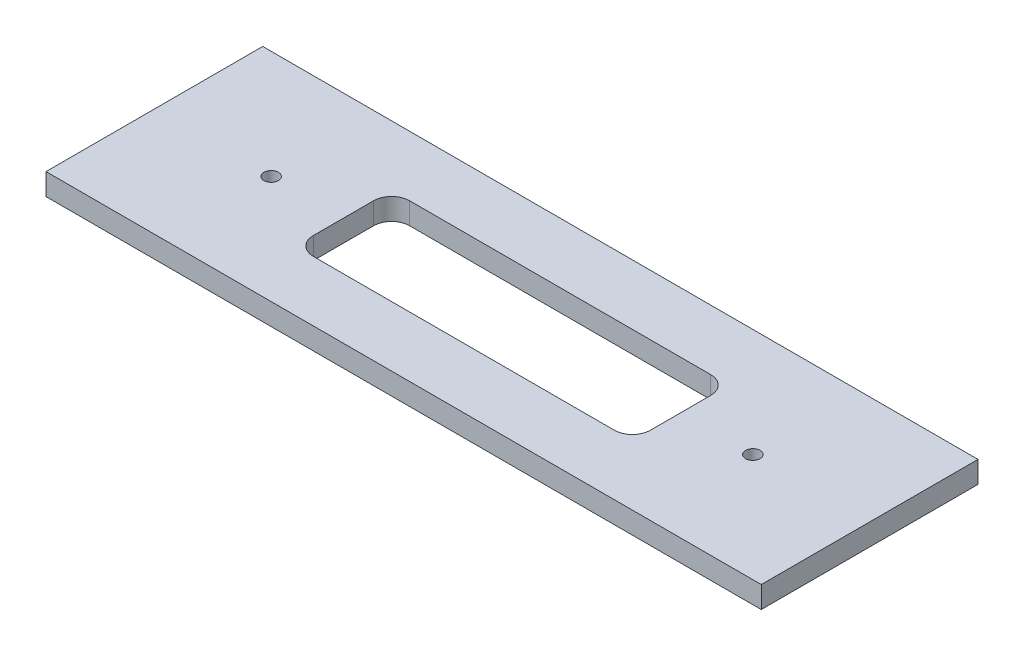
ISO-10303-21;
HEADER;
FILE_DESCRIPTION(('STEP AP214'),'2;1');
FILE_NAME('part.step','',(''),(''),'','','');
FILE_SCHEMA(('AUTOMOTIVE_DESIGN { 1 0 10303 214 1 1 1 1 }'));
ENDSEC;
DATA;
#1=APPLICATION_CONTEXT('core data for automotive mechanical design processes');
#2=APPLICATION_PROTOCOL_DEFINITION('international standard','automotive_design',2000,#1);
#3=PRODUCT_CONTEXT('',#1,'mechanical');
#4=PRODUCT('Part','Part','',(#3));
#5=PRODUCT_RELATED_PRODUCT_CATEGORY('part','',(#4));
#6=PRODUCT_DEFINITION_FORMATION('','',#4);
#7=PRODUCT_DEFINITION_CONTEXT('part definition',#1,'design');
#8=PRODUCT_DEFINITION('design','',#6,#7);
#9=PRODUCT_DEFINITION_SHAPE('','',#8);
#10=(LENGTH_UNIT() NAMED_UNIT(*) SI_UNIT(.MILLI.,.METRE.));
#11=(NAMED_UNIT(*) PLANE_ANGLE_UNIT() SI_UNIT($,.RADIAN.));
#12=(NAMED_UNIT(*) SI_UNIT($,.STERADIAN.) SOLID_ANGLE_UNIT());
#13=UNCERTAINTY_MEASURE_WITH_UNIT(LENGTH_MEASURE(1.E-05),#10,'distance_accuracy_value','');
#14=(GEOMETRIC_REPRESENTATION_CONTEXT(3) GLOBAL_UNCERTAINTY_ASSIGNED_CONTEXT((#13)) GLOBAL_UNIT_ASSIGNED_CONTEXT((#10,
#11,#12)) REPRESENTATION_CONTEXT('',''));
#15=CARTESIAN_POINT('',(0.,0.,0.));
#16=DIRECTION('',(0.,0.,1.));
#17=DIRECTION('',(1.,0.,0.));
#18=AXIS2_PLACEMENT_3D('',#15,#16,#17);
#19=CARTESIAN_POINT('',(297.,18.,90.));
#20=DIRECTION('',(-1.,0.,0.));
#21=DIRECTION('',(0.,0.,1.));
#22=AXIS2_PLACEMENT_3D('',#19,#20,#21);
#23=PLANE('',#22);
#24=DIRECTION('',(0.,0.,-1.));
#25=VECTOR('',#24,1.);
#26=CARTESIAN_POINT('',(297.,0.,90.));
#27=LINE('',#26,#25);
#28=CARTESIAN_POINT('',(297.,0.,90.));
#29=VERTEX_POINT('',#28);
#30=CARTESIAN_POINT('',(297.,0.,-90.));
#31=VERTEX_POINT('',#30);
#32=EDGE_CURVE('E183',#29,#31,#27,.T.);
#33=ORIENTED_EDGE('',*,*,#32,.T.);
#34=DIRECTION('',(0.,-1.,0.));
#35=VECTOR('',#34,1.);
#36=CARTESIAN_POINT('',(297.,18.,-90.));
#37=LINE('',#36,#35);
#38=CARTESIAN_POINT('',(297.,18.,-90.));
#39=VERTEX_POINT('',#38);
#40=EDGE_CURVE('E199',#39,#31,#37,.T.);
#41=ORIENTED_EDGE('',*,*,#40,.F.);
#42=DIRECTION('',(0.,0.,-1.));
#43=VECTOR('',#42,1.);
#44=CARTESIAN_POINT('',(297.,18.,90.));
#45=LINE('',#44,#43);
#46=CARTESIAN_POINT('',(297.,18.,90.));
#47=VERTEX_POINT('',#46);
#48=EDGE_CURVE('E172',#47,#39,#45,.T.);
#49=ORIENTED_EDGE('',*,*,#48,.F.);
#50=DIRECTION('',(0.,-1.,0.));
#51=VECTOR('',#50,1.);
#52=CARTESIAN_POINT('',(297.,18.,90.));
#53=LINE('',#52,#51);
#54=EDGE_CURVE('E182',#47,#29,#53,.T.);
#55=ORIENTED_EDGE('',*,*,#54,.T.);
#56=EDGE_LOOP('',(#33,#41,#49,#55));
#57=FACE_BOUND('',#56,.T.);
#58=ADVANCED_FACE('F33',(#57),#23,.F.);
#59=CARTESIAN_POINT('',(-297.,18.,-90.));
#60=DIRECTION('',(0.,0.,1.));
#61=DIRECTION('',(1.,0.,0.));
#62=AXIS2_PLACEMENT_3D('',#59,#60,#61);
#63=PLANE('',#62);
#64=DIRECTION('',(-1.,0.,0.));
#65=VECTOR('',#64,1.);
#66=CARTESIAN_POINT('',(-297.,0.,-90.));
#67=LINE('',#66,#65);
#68=CARTESIAN_POINT('',(-297.,0.,-90.));
#69=VERTEX_POINT('',#68);
#70=EDGE_CURVE('E186',#31,#69,#67,.T.);
#71=ORIENTED_EDGE('',*,*,#70,.T.);
#72=DIRECTION('',(0.,-1.,0.));
#73=VECTOR('',#72,1.);
#74=CARTESIAN_POINT('',(-297.,18.,-90.));
#75=LINE('',#74,#73);
#76=CARTESIAN_POINT('',(-297.,18.,-90.));
#77=VERTEX_POINT('',#76);
#78=EDGE_CURVE('E196',#77,#69,#75,.T.);
#79=ORIENTED_EDGE('',*,*,#78,.F.);
#80=DIRECTION('',(-1.,0.,0.));
#81=VECTOR('',#80,1.);
#82=CARTESIAN_POINT('',(-297.,18.,-90.));
#83=LINE('',#82,#81);
#84=EDGE_CURVE('E175',#39,#77,#83,.T.);
#85=ORIENTED_EDGE('',*,*,#84,.F.);
#86=ORIENTED_EDGE('',*,*,#40,.T.);
#87=EDGE_LOOP('',(#71,#79,#85,#86));
#88=FACE_BOUND('',#87,.T.);
#89=ADVANCED_FACE('F247',(#88),#63,.F.);
#90=CARTESIAN_POINT('',(-297.,18.,90.));
#91=DIRECTION('',(1.,0.,0.));
#92=DIRECTION('',(0.,0.,-1.));
#93=AXIS2_PLACEMENT_3D('',#90,#91,#92);
#94=PLANE('',#93);
#95=DIRECTION('',(0.,0.,1.));
#96=VECTOR('',#95,1.);
#97=CARTESIAN_POINT('',(-297.,0.,90.));
#98=LINE('',#97,#96);
#99=CARTESIAN_POINT('',(-297.,0.,90.));
#100=VERTEX_POINT('',#99);
#101=EDGE_CURVE('E188',#69,#100,#98,.T.);
#102=ORIENTED_EDGE('',*,*,#101,.T.);
#103=DIRECTION('',(0.,-1.,0.));
#104=VECTOR('',#103,1.);
#105=CARTESIAN_POINT('',(-297.,18.,90.));
#106=LINE('',#105,#104);
#107=CARTESIAN_POINT('',(-297.,18.,90.));
#108=VERTEX_POINT('',#107);
#109=EDGE_CURVE('E193',#108,#100,#106,.T.);
#110=ORIENTED_EDGE('',*,*,#109,.F.);
#111=DIRECTION('',(0.,0.,1.));
#112=VECTOR('',#111,1.);
#113=CARTESIAN_POINT('',(-297.,18.,90.));
#114=LINE('',#113,#112);
#115=EDGE_CURVE('E178',#77,#108,#114,.T.);
#116=ORIENTED_EDGE('',*,*,#115,.F.);
#117=ORIENTED_EDGE('',*,*,#78,.T.);
#118=EDGE_LOOP('',(#102,#110,#116,#117));
#119=FACE_BOUND('',#118,.T.);
#120=ADVANCED_FACE('F244',(#119),#94,.F.);
#121=CARTESIAN_POINT('',(-297.,18.,90.));
#122=DIRECTION('',(0.,0.,-1.));
#123=DIRECTION('',(-1.,0.,0.));
#124=AXIS2_PLACEMENT_3D('',#121,#122,#123);
#125=PLANE('',#124);
#126=DIRECTION('',(1.,0.,0.));
#127=VECTOR('',#126,1.);
#128=CARTESIAN_POINT('',(-297.,0.,90.));
#129=LINE('',#128,#127);
#130=EDGE_CURVE('E176',#100,#29,#129,.T.);
#131=ORIENTED_EDGE('',*,*,#130,.T.);
#132=ORIENTED_EDGE('',*,*,#54,.F.);
#133=DIRECTION('',(1.,0.,0.));
#134=VECTOR('',#133,1.);
#135=CARTESIAN_POINT('',(-297.,18.,90.));
#136=LINE('',#135,#134);
#137=EDGE_CURVE('E180',#108,#47,#136,.T.);
#138=ORIENTED_EDGE('',*,*,#137,.F.);
#139=ORIENTED_EDGE('',*,*,#109,.T.);
#140=EDGE_LOOP('',(#131,#132,#138,#139));
#141=FACE_BOUND('',#140,.T.);
#142=ADVANCED_FACE('F240',(#141),#125,.F.);
#143=CARTESIAN_POINT('',(0.,18.,0.));
#144=DIRECTION('',(0.,-1.,0.));
#145=DIRECTION('',(0.,0.,-1.));
#146=AXIS2_PLACEMENT_3D('',#143,#144,#145);
#147=PLANE('',#146);
#148=CARTESIAN_POINT('',(200.,18.,0.));
#149=DIRECTION('',(0.,1.,0.));
#150=DIRECTION('',(0.,0.,1.));
#151=AXIS2_PLACEMENT_3D('',#148,#149,#150);
#152=CIRCLE('',#151,6.00000000000002);
#153=CARTESIAN_POINT('',(200.,18.,6.00000000000002));
#154=VERTEX_POINT('',#153);
#155=EDGE_CURVE('E378',#154,#154,#152,.T.);
#156=ORIENTED_EDGE('',*,*,#155,.F.);
#157=EDGE_LOOP('',(#156));
#158=FACE_BOUND('',#157,.T.);
#159=CARTESIAN_POINT('',(-200.,18.,0.));
#160=DIRECTION('',(0.,1.,0.));
#161=DIRECTION('',(0.,0.,1.));
#162=AXIS2_PLACEMENT_3D('',#159,#160,#161);
#163=CIRCLE('',#162,6.00000000000002);
#164=CARTESIAN_POINT('',(-200.,18.,6.00000000000002));
#165=VERTEX_POINT('',#164);
#166=EDGE_CURVE('E377',#165,#165,#163,.T.);
#167=ORIENTED_EDGE('',*,*,#166,.F.);
#168=EDGE_LOOP('',(#167));
#169=FACE_BOUND('',#168,.T.);
#170=DIRECTION('',(1.,0.,0.));
#171=VECTOR('',#170,1.);
#172=CARTESIAN_POINT('',(-125.,18.,40.));
#173=LINE('',#172,#171);
#174=CARTESIAN_POINT('',(-125.,18.,40.));
#175=VERTEX_POINT('',#174);
#176=CARTESIAN_POINT('',(125.,18.,40.));
#177=VERTEX_POINT('',#176);
#178=EDGE_CURVE('E134',#175,#177,#173,.T.);
#179=ORIENTED_EDGE('',*,*,#178,.F.);
#180=CARTESIAN_POINT('',(-125.,18.,25.));
#181=DIRECTION('',(0.,1.,0.));
#182=DIRECTION('',(0.,0.,-1.));
#183=AXIS2_PLACEMENT_3D('',#180,#181,#182);
#184=CIRCLE('',#183,15.);
#185=CARTESIAN_POINT('',(-140.,18.,24.9999999999999));
#186=VERTEX_POINT('',#185);
#187=EDGE_CURVE('E49',#186,#175,#184,.T.);
#188=ORIENTED_EDGE('',*,*,#187,.F.);
#189=DIRECTION('',(0.,0.,1.));
#190=VECTOR('',#189,1.);
#191=CARTESIAN_POINT('',(-140.,18.,24.9999999999999));
#192=LINE('',#191,#190);
#193=CARTESIAN_POINT('',(-140.,18.,-24.9999999999999));
#194=VERTEX_POINT('',#193);
#195=EDGE_CURVE('E156',#194,#186,#192,.T.);
#196=ORIENTED_EDGE('',*,*,#195,.F.);
#197=CARTESIAN_POINT('',(-125.,18.,-25.));
#198=DIRECTION('',(0.,1.,0.));
#199=DIRECTION('',(0.,0.,-1.));
#200=AXIS2_PLACEMENT_3D('',#197,#198,#199);
#201=CIRCLE('',#200,15.);
#202=CARTESIAN_POINT('',(-125.,18.,-40.));
#203=VERTEX_POINT('',#202);
#204=EDGE_CURVE('E153',#203,#194,#201,.T.);
#205=ORIENTED_EDGE('',*,*,#204,.F.);
#206=DIRECTION('',(-1.,0.,0.));
#207=VECTOR('',#206,1.);
#208=CARTESIAN_POINT('',(-125.,18.,-40.));
#209=LINE('',#208,#207);
#210=CARTESIAN_POINT('',(125.,18.,-40.));
#211=VERTEX_POINT('',#210);
#212=EDGE_CURVE('E150',#211,#203,#209,.T.);
#213=ORIENTED_EDGE('',*,*,#212,.F.);
#214=CARTESIAN_POINT('',(125.,18.,-25.));
#215=DIRECTION('',(0.,1.,0.));
#216=DIRECTION('',(0.,0.,-1.));
#217=AXIS2_PLACEMENT_3D('',#214,#215,#216);
#218=CIRCLE('',#217,15.);
#219=CARTESIAN_POINT('',(140.,18.,-24.9999999999999));
#220=VERTEX_POINT('',#219);
#221=EDGE_CURVE('E144',#220,#211,#218,.T.);
#222=ORIENTED_EDGE('',*,*,#221,.F.);
#223=DIRECTION('',(0.,0.,-1.));
#224=VECTOR('',#223,1.);
#225=CARTESIAN_POINT('',(140.,18.,24.9999999999999));
#226=LINE('',#225,#224);
#227=CARTESIAN_POINT('',(140.,18.,24.9999999999999));
#228=VERTEX_POINT('',#227);
#229=EDGE_CURVE('E142',#228,#220,#226,.T.);
#230=ORIENTED_EDGE('',*,*,#229,.F.);
#231=CARTESIAN_POINT('',(125.,18.,25.));
#232=DIRECTION('',(0.,1.,0.));
#233=DIRECTION('',(0.,0.,1.));
#234=AXIS2_PLACEMENT_3D('',#231,#232,#233);
#235=CIRCLE('',#234,15.);
#236=EDGE_CURVE('E125',#177,#228,#235,.T.);
#237=ORIENTED_EDGE('',*,*,#236,.F.);
#238=EDGE_LOOP('',(#179,#188,#196,#205,#213,#222,#230,#237));
#239=FACE_BOUND('',#238,.T.);
#240=ORIENTED_EDGE('',*,*,#48,.T.);
#241=ORIENTED_EDGE('',*,*,#84,.T.);
#242=ORIENTED_EDGE('',*,*,#115,.T.);
#243=ORIENTED_EDGE('',*,*,#137,.T.);
#244=EDGE_LOOP('',(#240,#241,#242,#243));
#245=FACE_BOUND('',#244,.T.);
#246=ADVANCED_FACE('F138',(#158,#169,#239,#245),#147,.F.);
#247=CARTESIAN_POINT('',(0.,0.,0.));
#248=DIRECTION('',(0.,-1.,0.));
#249=DIRECTION('',(0.,0.,-1.));
#250=AXIS2_PLACEMENT_3D('',#247,#248,#249);
#251=PLANE('',#250);
#252=CARTESIAN_POINT('',(200.,0.,0.));
#253=DIRECTION('',(0.,-1.,0.));
#254=DIRECTION('',(0.,0.,-1.));
#255=AXIS2_PLACEMENT_3D('',#252,#253,#254);
#256=CIRCLE('',#255,6.00000000000002);
#257=CARTESIAN_POINT('',(200.,0.,-6.00000000000002));
#258=VERTEX_POINT('',#257);
#259=EDGE_CURVE('E36',#258,#258,#256,.T.);
#260=ORIENTED_EDGE('',*,*,#259,.F.);
#261=EDGE_LOOP('',(#260));
#262=FACE_BOUND('',#261,.T.);
#263=CARTESIAN_POINT('',(-200.,0.,0.));
#264=DIRECTION('',(0.,-1.,0.));
#265=DIRECTION('',(0.,0.,-1.));
#266=AXIS2_PLACEMENT_3D('',#263,#264,#265);
#267=CIRCLE('',#266,6.00000000000002);
#268=CARTESIAN_POINT('',(-200.,0.,-6.00000000000002));
#269=VERTEX_POINT('',#268);
#270=EDGE_CURVE('E161',#269,#269,#267,.T.);
#271=ORIENTED_EDGE('',*,*,#270,.F.);
#272=EDGE_LOOP('',(#271));
#273=FACE_BOUND('',#272,.T.);
#274=CARTESIAN_POINT('',(-125.,0.,25.));
#275=DIRECTION('',(0.,-1.,0.));
#276=DIRECTION('',(0.,0.,-1.));
#277=AXIS2_PLACEMENT_3D('',#274,#275,#276);
#278=CIRCLE('',#277,15.);
#279=CARTESIAN_POINT('',(-125.,0.,40.));
#280=VERTEX_POINT('',#279);
#281=CARTESIAN_POINT('',(-140.,0.,24.9999999999999));
#282=VERTEX_POINT('',#281);
#283=EDGE_CURVE('E11',#280,#282,#278,.T.);
#284=ORIENTED_EDGE('',*,*,#283,.F.);
#285=DIRECTION('',(-1.,0.,0.));
#286=VECTOR('',#285,1.);
#287=CARTESIAN_POINT('',(0.,0.,40.));
#288=LINE('',#287,#286);
#289=CARTESIAN_POINT('',(125.,0.,40.));
#290=VERTEX_POINT('',#289);
#291=EDGE_CURVE('E202',#290,#280,#288,.T.);
#292=ORIENTED_EDGE('',*,*,#291,.F.);
#293=CARTESIAN_POINT('',(125.,0.,25.));
#294=DIRECTION('',(0.,-1.,0.));
#295=DIRECTION('',(0.,0.,-1.));
#296=AXIS2_PLACEMENT_3D('',#293,#294,#295);
#297=CIRCLE('',#296,15.);
#298=CARTESIAN_POINT('',(140.,0.,24.9999999999999));
#299=VERTEX_POINT('',#298);
#300=EDGE_CURVE('E128',#299,#290,#297,.T.);
#301=ORIENTED_EDGE('',*,*,#300,.F.);
#302=DIRECTION('',(0.,0.,1.));
#303=VECTOR('',#302,1.);
#304=CARTESIAN_POINT('',(140.,0.,0.));
#305=LINE('',#304,#303);
#306=CARTESIAN_POINT('',(140.,0.,-24.9999999999999));
#307=VERTEX_POINT('',#306);
#308=EDGE_CURVE('E205',#307,#299,#305,.T.);
#309=ORIENTED_EDGE('',*,*,#308,.F.);
#310=CARTESIAN_POINT('',(125.,0.,-25.));
#311=DIRECTION('',(0.,-1.,0.));
#312=DIRECTION('',(0.,0.,-1.));
#313=AXIS2_PLACEMENT_3D('',#310,#311,#312);
#314=CIRCLE('',#313,15.);
#315=CARTESIAN_POINT('',(125.,0.,-40.));
#316=VERTEX_POINT('',#315);
#317=EDGE_CURVE('E207',#316,#307,#314,.T.);
#318=ORIENTED_EDGE('',*,*,#317,.F.);
#319=DIRECTION('',(1.,0.,0.));
#320=VECTOR('',#319,1.);
#321=CARTESIAN_POINT('',(0.,0.,-40.));
#322=LINE('',#321,#320);
#323=CARTESIAN_POINT('',(-125.,0.,-40.));
#324=VERTEX_POINT('',#323);
#325=EDGE_CURVE('E209',#324,#316,#322,.T.);
#326=ORIENTED_EDGE('',*,*,#325,.F.);
#327=CARTESIAN_POINT('',(-125.,0.,-25.));
#328=DIRECTION('',(0.,-1.,0.));
#329=DIRECTION('',(0.,0.,-1.));
#330=AXIS2_PLACEMENT_3D('',#327,#328,#329);
#331=CIRCLE('',#330,15.);
#332=CARTESIAN_POINT('',(-140.,0.,-24.9999999999999));
#333=VERTEX_POINT('',#332);
#334=EDGE_CURVE('E211',#333,#324,#331,.T.);
#335=ORIENTED_EDGE('',*,*,#334,.F.);
#336=DIRECTION('',(0.,0.,-1.));
#337=VECTOR('',#336,1.);
#338=CARTESIAN_POINT('',(-140.,0.,0.));
#339=LINE('',#338,#337);
#340=EDGE_CURVE('E41',#282,#333,#339,.T.);
#341=ORIENTED_EDGE('',*,*,#340,.F.);
#342=EDGE_LOOP('',(#284,#292,#301,#309,#318,#326,#335,#341));
#343=FACE_BOUND('',#342,.T.);
#344=ORIENTED_EDGE('',*,*,#32,.F.);
#345=ORIENTED_EDGE('',*,*,#130,.F.);
#346=ORIENTED_EDGE('',*,*,#101,.F.);
#347=ORIENTED_EDGE('',*,*,#70,.F.);
#348=EDGE_LOOP('',(#344,#345,#346,#347));
#349=FACE_BOUND('',#348,.T.);
#350=ADVANCED_FACE('F222',(#262,#273,#343,#349),#251,.T.);
#351=CARTESIAN_POINT('',(-125.,-22.,25.));
#352=DIRECTION('',(0.,1.,0.));
#353=DIRECTION('',(0.,0.,1.));
#354=AXIS2_PLACEMENT_3D('',#351,#352,#353);
#355=CYLINDRICAL_SURFACE('',#354,15.);
#356=ORIENTED_EDGE('',*,*,#283,.T.);
#357=DIRECTION('',(0.,1.,0.));
#358=VECTOR('',#357,1.);
#359=CARTESIAN_POINT('',(-140.,-22.,24.9999999999999));
#360=LINE('',#359,#358);
#361=EDGE_CURVE('E159',#282,#186,#360,.T.);
#362=ORIENTED_EDGE('',*,*,#361,.T.);
#363=ORIENTED_EDGE('',*,*,#187,.T.);
#364=DIRECTION('',(0.,1.,0.));
#365=VECTOR('',#364,1.);
#366=CARTESIAN_POINT('',(-125.,-22.,40.));
#367=LINE('',#366,#365);
#368=EDGE_CURVE('E131',#280,#175,#367,.T.);
#369=ORIENTED_EDGE('',*,*,#368,.F.);
#370=EDGE_LOOP('',(#356,#362,#363,#369));
#371=FACE_BOUND('',#370,.T.);
#372=ADVANCED_FACE('F225',(#371),#355,.F.);
#373=CARTESIAN_POINT('',(-140.,-22.,24.9999999999999));
#374=DIRECTION('',(-1.,0.,0.));
#375=DIRECTION('',(0.,0.,1.));
#376=AXIS2_PLACEMENT_3D('',#373,#374,#375);
#377=PLANE('',#376);
#378=ORIENTED_EDGE('',*,*,#340,.T.);
#379=DIRECTION('',(0.,1.,0.));
#380=VECTOR('',#379,1.);
#381=CARTESIAN_POINT('',(-140.,-22.,-24.9999999999999));
#382=LINE('',#381,#380);
#383=EDGE_CURVE('E162',#333,#194,#382,.T.);
#384=ORIENTED_EDGE('',*,*,#383,.T.);
#385=ORIENTED_EDGE('',*,*,#195,.T.);
#386=ORIENTED_EDGE('',*,*,#361,.F.);
#387=EDGE_LOOP('',(#378,#384,#385,#386));
#388=FACE_BOUND('',#387,.T.);
#389=ADVANCED_FACE('F289',(#388),#377,.F.);
#390=CARTESIAN_POINT('',(-125.,-22.,-25.));
#391=DIRECTION('',(0.,1.,0.));
#392=DIRECTION('',(0.,0.,1.));
#393=AXIS2_PLACEMENT_3D('',#390,#391,#392);
#394=CYLINDRICAL_SURFACE('',#393,15.);
#395=ORIENTED_EDGE('',*,*,#334,.T.);
#396=DIRECTION('',(0.,1.,0.));
#397=VECTOR('',#396,1.);
#398=CARTESIAN_POINT('',(-125.,-22.,-40.));
#399=LINE('',#398,#397);
#400=EDGE_CURVE('E164',#324,#203,#399,.T.);
#401=ORIENTED_EDGE('',*,*,#400,.T.);
#402=ORIENTED_EDGE('',*,*,#204,.T.);
#403=ORIENTED_EDGE('',*,*,#383,.F.);
#404=EDGE_LOOP('',(#395,#401,#402,#403));
#405=FACE_BOUND('',#404,.T.);
#406=ADVANCED_FACE('F294',(#405),#394,.F.);
#407=CARTESIAN_POINT('',(-125.,-22.,-40.));
#408=DIRECTION('',(0.,0.,-1.));
#409=DIRECTION('',(-1.,0.,0.));
#410=AXIS2_PLACEMENT_3D('',#407,#408,#409);
#411=PLANE('',#410);
#412=ORIENTED_EDGE('',*,*,#325,.T.);
#413=DIRECTION('',(0.,1.,0.));
#414=VECTOR('',#413,1.);
#415=CARTESIAN_POINT('',(125.,-22.,-40.));
#416=LINE('',#415,#414);
#417=EDGE_CURVE('E166',#316,#211,#416,.T.);
#418=ORIENTED_EDGE('',*,*,#417,.T.);
#419=ORIENTED_EDGE('',*,*,#212,.T.);
#420=ORIENTED_EDGE('',*,*,#400,.F.);
#421=EDGE_LOOP('',(#412,#418,#419,#420));
#422=FACE_BOUND('',#421,.T.);
#423=ADVANCED_FACE('F302',(#422),#411,.F.);
#424=CARTESIAN_POINT('',(125.,-22.,-25.));
#425=DIRECTION('',(0.,1.,0.));
#426=DIRECTION('',(0.,0.,1.));
#427=AXIS2_PLACEMENT_3D('',#424,#425,#426);
#428=CYLINDRICAL_SURFACE('',#427,15.);
#429=ORIENTED_EDGE('',*,*,#317,.T.);
#430=DIRECTION('',(0.,1.,0.));
#431=VECTOR('',#430,1.);
#432=CARTESIAN_POINT('',(140.,-22.,-24.9999999999999));
#433=LINE('',#432,#431);
#434=EDGE_CURVE('E168',#307,#220,#433,.T.);
#435=ORIENTED_EDGE('',*,*,#434,.T.);
#436=ORIENTED_EDGE('',*,*,#221,.T.);
#437=ORIENTED_EDGE('',*,*,#417,.F.);
#438=EDGE_LOOP('',(#429,#435,#436,#437));
#439=FACE_BOUND('',#438,.T.);
#440=ADVANCED_FACE('F310',(#439),#428,.F.);
#441=CARTESIAN_POINT('',(140.,-22.,24.9999999999999));
#442=DIRECTION('',(1.,0.,0.));
#443=DIRECTION('',(0.,0.,-1.));
#444=AXIS2_PLACEMENT_3D('',#441,#442,#443);
#445=PLANE('',#444);
#446=ORIENTED_EDGE('',*,*,#308,.T.);
#447=DIRECTION('',(0.,1.,0.));
#448=VECTOR('',#447,1.);
#449=CARTESIAN_POINT('',(140.,-22.,24.9999999999999));
#450=LINE('',#449,#448);
#451=EDGE_CURVE('E130',#299,#228,#450,.T.);
#452=ORIENTED_EDGE('',*,*,#451,.T.);
#453=ORIENTED_EDGE('',*,*,#229,.T.);
#454=ORIENTED_EDGE('',*,*,#434,.F.);
#455=EDGE_LOOP('',(#446,#452,#453,#454));
#456=FACE_BOUND('',#455,.T.);
#457=ADVANCED_FACE('F318',(#456),#445,.F.);
#458=CARTESIAN_POINT('',(125.,-22.,25.));
#459=DIRECTION('',(0.,1.,0.));
#460=DIRECTION('',(0.,0.,1.));
#461=AXIS2_PLACEMENT_3D('',#458,#459,#460);
#462=CYLINDRICAL_SURFACE('',#461,15.);
#463=ORIENTED_EDGE('',*,*,#300,.T.);
#464=DIRECTION('',(0.,1.,0.));
#465=VECTOR('',#464,1.);
#466=CARTESIAN_POINT('',(125.,-22.,40.));
#467=LINE('',#466,#465);
#468=EDGE_CURVE('E57',#290,#177,#467,.T.);
#469=ORIENTED_EDGE('',*,*,#468,.T.);
#470=ORIENTED_EDGE('',*,*,#236,.T.);
#471=ORIENTED_EDGE('',*,*,#451,.F.);
#472=EDGE_LOOP('',(#463,#469,#470,#471));
#473=FACE_BOUND('',#472,.T.);
#474=ADVANCED_FACE('F122',(#473),#462,.F.);
#475=CARTESIAN_POINT('',(-125.,-22.,40.));
#476=DIRECTION('',(0.,0.,1.));
#477=DIRECTION('',(1.,0.,0.));
#478=AXIS2_PLACEMENT_3D('',#475,#476,#477);
#479=PLANE('',#478);
#480=ORIENTED_EDGE('',*,*,#291,.T.);
#481=ORIENTED_EDGE('',*,*,#368,.T.);
#482=ORIENTED_EDGE('',*,*,#178,.T.);
#483=ORIENTED_EDGE('',*,*,#468,.F.);
#484=EDGE_LOOP('',(#480,#481,#482,#483));
#485=FACE_BOUND('',#484,.T.);
#486=ADVANCED_FACE('F135',(#485),#479,.F.);
#487=CARTESIAN_POINT('',(-200.,-22.,0.));
#488=DIRECTION('',(0.,1.,0.));
#489=DIRECTION('',(0.,0.,1.));
#490=AXIS2_PLACEMENT_3D('',#487,#488,#489);
#491=CYLINDRICAL_SURFACE('',#490,6.00000000000002);
#492=ORIENTED_EDGE('',*,*,#270,.T.);
#493=EDGE_LOOP('',(#492));
#494=FACE_BOUND('',#493,.T.);
#495=ORIENTED_EDGE('',*,*,#166,.T.);
#496=EDGE_LOOP('',(#495));
#497=FACE_BOUND('',#496,.T.);
#498=ADVANCED_FACE('F339',(#494,#497),#491,.F.);
#499=CARTESIAN_POINT('',(200.,-22.,0.));
#500=DIRECTION('',(0.,1.,0.));
#501=DIRECTION('',(0.,0.,1.));
#502=AXIS2_PLACEMENT_3D('',#499,#500,#501);
#503=CYLINDRICAL_SURFACE('',#502,6.00000000000002);
#504=ORIENTED_EDGE('',*,*,#259,.T.);
#505=EDGE_LOOP('',(#504));
#506=FACE_BOUND('',#505,.T.);
#507=ORIENTED_EDGE('',*,*,#155,.T.);
#508=EDGE_LOOP('',(#507));
#509=FACE_BOUND('',#508,.T.);
#510=ADVANCED_FACE('F219',(#506,#509),#503,.F.);
#511=CLOSED_SHELL('',(#58,#89,#120,#142,#246,#350,#372,#389,#406,#423,#440,#457,#474,#486,#498,#510));
#512=MANIFOLD_SOLID_BREP('B2',#511);
#513=ADVANCED_BREP_SHAPE_REPRESENTATION('',(#18,#512),#14);
#514=SHAPE_DEFINITION_REPRESENTATION(#9,#513);
ENDSEC;
END-ISO-10303-21;
